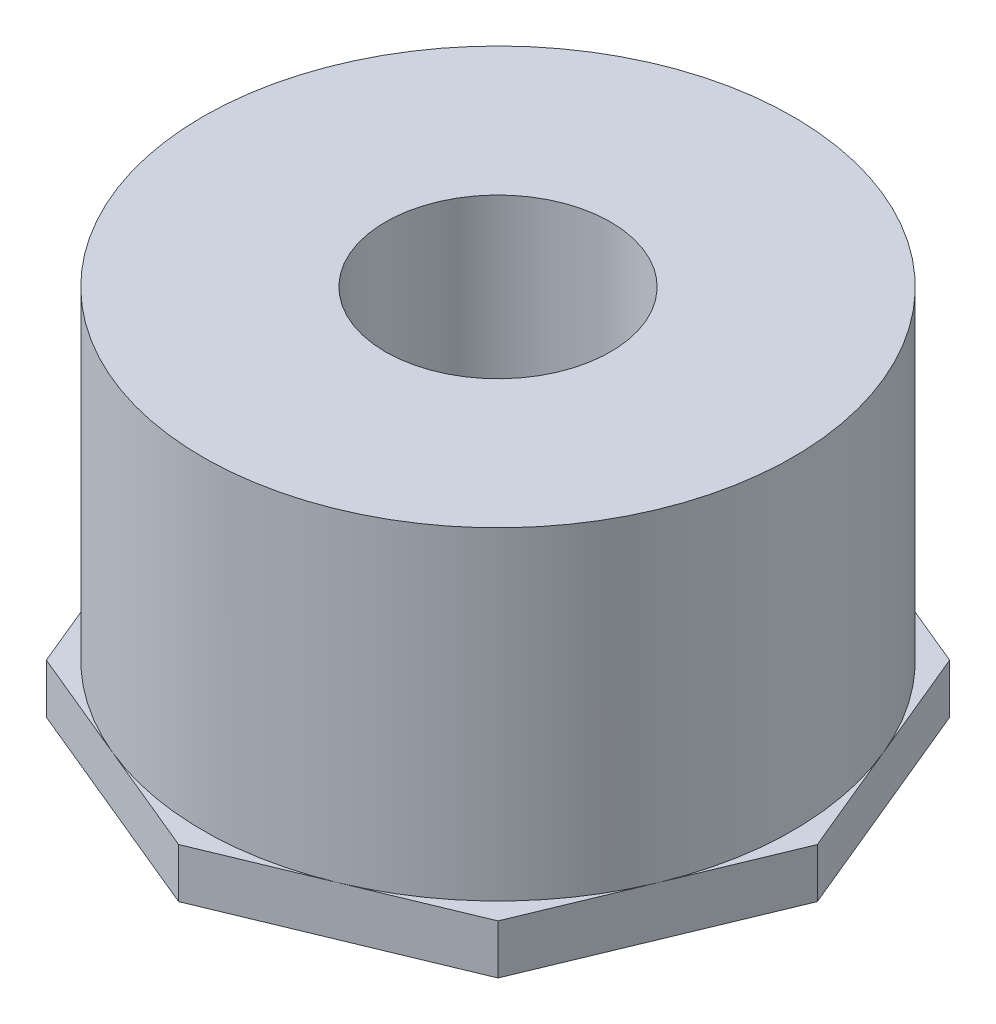
ISO-10303-21;
HEADER;
FILE_DESCRIPTION(('STEP AP214'),'2;1');
FILE_NAME('part.step','',(''),(''),'','','');
FILE_SCHEMA(('AUTOMOTIVE_DESIGN { 1 0 10303 214 1 1 1 1 }'));
ENDSEC;
DATA;
#1=APPLICATION_CONTEXT('core data for automotive mechanical design processes');
#2=APPLICATION_PROTOCOL_DEFINITION('international standard','automotive_design',2000,#1);
#3=PRODUCT_CONTEXT('',#1,'mechanical');
#4=PRODUCT('Part','Part','',(#3));
#5=PRODUCT_RELATED_PRODUCT_CATEGORY('part','',(#4));
#6=PRODUCT_DEFINITION_FORMATION('','',#4);
#7=PRODUCT_DEFINITION_CONTEXT('part definition',#1,'design');
#8=PRODUCT_DEFINITION('design','',#6,#7);
#9=PRODUCT_DEFINITION_SHAPE('','',#8);
#10=(LENGTH_UNIT() NAMED_UNIT(*) SI_UNIT(.MILLI.,.METRE.));
#11=(NAMED_UNIT(*) PLANE_ANGLE_UNIT() SI_UNIT($,.RADIAN.));
#12=(NAMED_UNIT(*) SI_UNIT($,.STERADIAN.) SOLID_ANGLE_UNIT());
#13=UNCERTAINTY_MEASURE_WITH_UNIT(LENGTH_MEASURE(1.E-05),#10,'distance_accuracy_value','');
#14=(GEOMETRIC_REPRESENTATION_CONTEXT(3) GLOBAL_UNCERTAINTY_ASSIGNED_CONTEXT((#13)) GLOBAL_UNIT_ASSIGNED_CONTEXT((#10,
#11,#12)) REPRESENTATION_CONTEXT('',''));
#15=CARTESIAN_POINT('',(0.,0.,0.));
#16=DIRECTION('',(0.,0.,1.));
#17=DIRECTION('',(1.,0.,0.));
#18=AXIS2_PLACEMENT_3D('',#15,#16,#17);
#19=CARTESIAN_POINT('',(0.,0.,0.));
#20=DIRECTION('',(0.,1.,0.));
#21=DIRECTION('',(-1.,0.,0.));
#22=AXIS2_PLACEMENT_3D('',#19,#20,#21);
#23=CYLINDRICAL_SURFACE('',#22,30.1625);
#24=CARTESIAN_POINT('',(0.,38.1,0.));
#25=DIRECTION('',(0.,1.,0.));
#26=DIRECTION('',(-1.,0.,0.));
#27=AXIS2_PLACEMENT_3D('',#24,#25,#26);
#28=CIRCLE('',#27,30.1625);
#29=CARTESIAN_POINT('',(-30.1625,38.1,0.));
#30=VERTEX_POINT('',#29);
#31=EDGE_CURVE('E206',#30,#30,#28,.T.);
#32=ORIENTED_EDGE('',*,*,#31,.F.);
#33=EDGE_LOOP('',(#32));
#34=FACE_BOUND('',#33,.T.);
#35=CARTESIAN_POINT('',(0.,5.0546,0.));
#36=DIRECTION('',(0.,-1.,0.));
#37=DIRECTION('',(1.,0.,0.));
#38=AXIS2_PLACEMENT_3D('',#35,#36,#37);
#39=CIRCLE('',#38,30.1625);
#40=CARTESIAN_POINT('',(27.8665163993717,5.0546,11.542689028712));
#41=VERTEX_POINT('',#40);
#42=CARTESIAN_POINT('',(27.8665163993717,5.0546,-11.542689028712));
#43=VERTEX_POINT('',#42);
#44=EDGE_CURVE('E47',#41,#43,#39,.F.);
#45=ORIENTED_EDGE('',*,*,#44,.T.);
#46=CARTESIAN_POINT('',(11.542689028712,5.0546,-27.8665163993717));
#47=VERTEX_POINT('',#46);
#48=EDGE_CURVE('E11',#43,#47,#39,.F.);
#49=ORIENTED_EDGE('',*,*,#48,.T.);
#50=CARTESIAN_POINT('',(-11.542689028712,5.0546,-27.8665163993717));
#51=VERTEX_POINT('',#50);
#52=EDGE_CURVE('E52',#47,#51,#39,.F.);
#53=ORIENTED_EDGE('',*,*,#52,.T.);
#54=CARTESIAN_POINT('',(-27.8665163993717,5.0546,-11.542689028712));
#55=VERTEX_POINT('',#54);
#56=EDGE_CURVE('E232',#51,#55,#39,.F.);
#57=ORIENTED_EDGE('',*,*,#56,.T.);
#58=CARTESIAN_POINT('',(-27.8665163993717,5.0546,11.542689028712));
#59=VERTEX_POINT('',#58);
#60=EDGE_CURVE('E230',#55,#59,#39,.F.);
#61=ORIENTED_EDGE('',*,*,#60,.T.);
#62=CARTESIAN_POINT('',(-11.542689028712,5.0546,27.8665163993717));
#63=VERTEX_POINT('',#62);
#64=EDGE_CURVE('E229',#59,#63,#39,.F.);
#65=ORIENTED_EDGE('',*,*,#64,.T.);
#66=CARTESIAN_POINT('',(11.542689028712,5.0546,27.8665163993717));
#67=VERTEX_POINT('',#66);
#68=EDGE_CURVE('E67',#63,#67,#39,.F.);
#69=ORIENTED_EDGE('',*,*,#68,.T.);
#70=EDGE_CURVE('E226',#67,#41,#39,.F.);
#71=ORIENTED_EDGE('',*,*,#70,.T.);
#72=EDGE_LOOP('',(#45,#49,#53,#57,#61,#65,#69,#71));
#73=FACE_BOUND('',#72,.T.);
#74=ADVANCED_FACE('F43',(#34,#73),#23,.T.);
#75=CARTESIAN_POINT('',(0.,38.1,0.));
#76=DIRECTION('',(0.,1.,0.));
#77=DIRECTION('',(-1.,0.,0.));
#78=AXIS2_PLACEMENT_3D('',#75,#76,#77);
#79=PLANE('',#78);
#80=CARTESIAN_POINT('',(0.,38.1,0.));
#81=DIRECTION('',(0.,-1.,0.));
#82=DIRECTION('',(0.,0.,-1.));
#83=AXIS2_PLACEMENT_3D('',#80,#81,#82);
#84=CIRCLE('',#83,11.5062);
#85=CARTESIAN_POINT('',(0.,38.1,-11.5062));
#86=VERTEX_POINT('',#85);
#87=EDGE_CURVE('E185',#86,#86,#84,.T.);
#88=ORIENTED_EDGE('',*,*,#87,.T.);
#89=EDGE_LOOP('',(#88));
#90=FACE_BOUND('',#89,.T.);
#91=ORIENTED_EDGE('',*,*,#31,.T.);
#92=EDGE_LOOP('',(#91));
#93=FACE_BOUND('',#92,.T.);
#94=ADVANCED_FACE('F277',(#90,#93),#79,.T.);
#95=CARTESIAN_POINT('',(23.085378057424,5.0546,23.085378057424));
#96=DIRECTION('',(0.38268343236509,0.,0.923879532511287));
#97=DIRECTION('',(0.923879532511287,0.,-0.38268343236509));
#98=AXIS2_PLACEMENT_3D('',#95,#96,#97);
#99=PLANE('',#98);
#100=DIRECTION('',(-0.923879532511287,0.,0.38268343236509));
#101=VECTOR('',#100,1.);
#102=CARTESIAN_POINT('',(23.085378057424,0.,23.085378057424));
#103=LINE('',#102,#101);
#104=CARTESIAN_POINT('',(23.085378057424,0.,23.085378057424));
#105=VERTEX_POINT('',#104);
#106=CARTESIAN_POINT('',(0.,0.,32.6476547413193));
#107=VERTEX_POINT('',#106);
#108=EDGE_CURVE('E183',#105,#107,#103,.T.);
#109=ORIENTED_EDGE('',*,*,#108,.F.);
#110=DIRECTION('',(0.,-1.,0.));
#111=VECTOR('',#110,1.);
#112=CARTESIAN_POINT('',(23.085378057424,5.0546,23.085378057424));
#113=LINE('',#112,#111);
#114=CARTESIAN_POINT('',(23.085378057424,5.0546,23.085378057424));
#115=VERTEX_POINT('',#114);
#116=EDGE_CURVE('E203',#115,#105,#113,.T.);
#117=ORIENTED_EDGE('',*,*,#116,.F.);
#118=DIRECTION('',(-0.923879532511287,0.,0.38268343236509));
#119=VECTOR('',#118,1.);
#120=CARTESIAN_POINT('',(23.085378057424,5.0546,23.085378057424));
#121=LINE('',#120,#119);
#122=EDGE_CURVE('E142',#115,#67,#121,.T.);
#123=ORIENTED_EDGE('',*,*,#122,.T.);
#124=CARTESIAN_POINT('',(0.,5.0546,32.6476547413193));
#125=VERTEX_POINT('',#124);
#126=EDGE_CURVE('E136',#67,#125,#121,.T.);
#127=ORIENTED_EDGE('',*,*,#126,.T.);
#128=DIRECTION('',(0.,-1.,0.));
#129=VECTOR('',#128,1.);
#130=CARTESIAN_POINT('',(0.,5.0546,32.6476547413193));
#131=LINE('',#130,#129);
#132=EDGE_CURVE('E139',#125,#107,#131,.T.);
#133=ORIENTED_EDGE('',*,*,#132,.T.);
#134=EDGE_LOOP('',(#109,#117,#123,#127,#133));
#135=FACE_BOUND('',#134,.T.);
#136=ADVANCED_FACE('F138',(#135),#99,.T.);
#137=CARTESIAN_POINT('',(32.6476547413193,5.0546,0.));
#138=DIRECTION('',(0.923879532511287,0.,0.38268343236509));
#139=DIRECTION('',(0.38268343236509,0.,-0.923879532511287));
#140=AXIS2_PLACEMENT_3D('',#137,#138,#139);
#141=PLANE('',#140);
#142=DIRECTION('',(-0.38268343236509,0.,0.923879532511287));
#143=VECTOR('',#142,1.);
#144=CARTESIAN_POINT('',(32.6476547413193,0.,0.));
#145=LINE('',#144,#143);
#146=CARTESIAN_POINT('',(32.6476547413193,0.,0.));
#147=VERTEX_POINT('',#146);
#148=EDGE_CURVE('E143',#147,#105,#145,.T.);
#149=ORIENTED_EDGE('',*,*,#148,.F.);
#150=DIRECTION('',(0.,-1.,0.));
#151=VECTOR('',#150,1.);
#152=CARTESIAN_POINT('',(32.6476547413193,5.0546,0.));
#153=LINE('',#152,#151);
#154=CARTESIAN_POINT('',(32.6476547413193,5.0546,0.));
#155=VERTEX_POINT('',#154);
#156=EDGE_CURVE('E207',#155,#147,#153,.T.);
#157=ORIENTED_EDGE('',*,*,#156,.F.);
#158=DIRECTION('',(-0.38268343236509,0.,0.923879532511287));
#159=VECTOR('',#158,1.);
#160=CARTESIAN_POINT('',(32.6476547413193,5.0546,0.));
#161=LINE('',#160,#159);
#162=EDGE_CURVE('E155',#155,#41,#161,.T.);
#163=ORIENTED_EDGE('',*,*,#162,.T.);
#164=EDGE_CURVE('E180',#41,#115,#161,.T.);
#165=ORIENTED_EDGE('',*,*,#164,.T.);
#166=ORIENTED_EDGE('',*,*,#116,.T.);
#167=EDGE_LOOP('',(#149,#157,#163,#165,#166));
#168=FACE_BOUND('',#167,.T.);
#169=ADVANCED_FACE('F287',(#168),#141,.T.);
#170=CARTESIAN_POINT('',(23.085378057424,5.0546,-23.085378057424));
#171=DIRECTION('',(0.923879532511287,0.,-0.38268343236509));
#172=DIRECTION('',(-0.38268343236509,0.,-0.923879532511287));
#173=AXIS2_PLACEMENT_3D('',#170,#171,#172);
#174=PLANE('',#173);
#175=ORIENTED_EDGE('',*,*,#156,.T.);
#176=DIRECTION('',(0.38268343236509,0.,0.923879532511287));
#177=VECTOR('',#176,1.);
#178=CARTESIAN_POINT('',(23.085378057424,0.,-23.085378057424));
#179=LINE('',#178,#177);
#180=CARTESIAN_POINT('',(23.085378057424,0.,-23.085378057424));
#181=VERTEX_POINT('',#180);
#182=EDGE_CURVE('E198',#181,#147,#179,.T.);
#183=ORIENTED_EDGE('',*,*,#182,.F.);
#184=DIRECTION('',(0.,-1.,0.));
#185=VECTOR('',#184,1.);
#186=CARTESIAN_POINT('',(23.085378057424,5.0546,-23.085378057424));
#187=LINE('',#186,#185);
#188=CARTESIAN_POINT('',(23.085378057424,5.0546,-23.085378057424));
#189=VERTEX_POINT('',#188);
#190=EDGE_CURVE('E210',#189,#181,#187,.T.);
#191=ORIENTED_EDGE('',*,*,#190,.F.);
#192=DIRECTION('',(0.38268343236509,0.,0.923879532511287));
#193=VECTOR('',#192,1.);
#194=CARTESIAN_POINT('',(23.085378057424,5.0546,-23.085378057424));
#195=LINE('',#194,#193);
#196=EDGE_CURVE('E59',#189,#43,#195,.T.);
#197=ORIENTED_EDGE('',*,*,#196,.T.);
#198=EDGE_CURVE('E178',#43,#155,#195,.T.);
#199=ORIENTED_EDGE('',*,*,#198,.T.);
#200=EDGE_LOOP('',(#175,#183,#191,#197,#199));
#201=FACE_BOUND('',#200,.T.);
#202=ADVANCED_FACE('F298',(#201),#174,.T.);
#203=CARTESIAN_POINT('',(0.,5.0546,-32.6476547413193));
#204=DIRECTION('',(0.382683432365089,0.,-0.923879532511287));
#205=DIRECTION('',(-0.923879532511287,0.,-0.382683432365089));
#206=AXIS2_PLACEMENT_3D('',#203,#204,#205);
#207=PLANE('',#206);
#208=DIRECTION('',(0.923879532511287,0.,0.382683432365089));
#209=VECTOR('',#208,1.);
#210=CARTESIAN_POINT('',(0.,0.,-32.6476547413193));
#211=LINE('',#210,#209);
#212=CARTESIAN_POINT('',(0.,0.,-32.6476547413193));
#213=VERTEX_POINT('',#212);
#214=EDGE_CURVE('E196',#213,#181,#211,.T.);
#215=ORIENTED_EDGE('',*,*,#214,.F.);
#216=DIRECTION('',(0.,-1.,0.));
#217=VECTOR('',#216,1.);
#218=CARTESIAN_POINT('',(0.,5.0546,-32.6476547413193));
#219=LINE('',#218,#217);
#220=CARTESIAN_POINT('',(0.,5.0546,-32.6476547413193));
#221=VERTEX_POINT('',#220);
#222=EDGE_CURVE('E213',#221,#213,#219,.T.);
#223=ORIENTED_EDGE('',*,*,#222,.F.);
#224=DIRECTION('',(0.923879532511287,0.,0.382683432365089));
#225=VECTOR('',#224,1.);
#226=CARTESIAN_POINT('',(0.,5.0546,-32.6476547413193));
#227=LINE('',#226,#225);
#228=EDGE_CURVE('E175',#221,#47,#227,.T.);
#229=ORIENTED_EDGE('',*,*,#228,.T.);
#230=EDGE_CURVE('E174',#47,#189,#227,.T.);
#231=ORIENTED_EDGE('',*,*,#230,.T.);
#232=ORIENTED_EDGE('',*,*,#190,.T.);
#233=EDGE_LOOP('',(#215,#223,#229,#231,#232));
#234=FACE_BOUND('',#233,.T.);
#235=ADVANCED_FACE('F245',(#234),#207,.T.);
#236=CARTESIAN_POINT('',(-23.085378057424,5.0546,-23.085378057424));
#237=DIRECTION('',(-0.382683432365089,0.,-0.923879532511287));
#238=DIRECTION('',(-0.923879532511287,0.,0.38268343236509));
#239=AXIS2_PLACEMENT_3D('',#236,#237,#238);
#240=PLANE('',#239);
#241=DIRECTION('',(0.923879532511287,0.,-0.382683432365089));
#242=VECTOR('',#241,1.);
#243=CARTESIAN_POINT('',(-23.085378057424,0.,-23.085378057424));
#244=LINE('',#243,#242);
#245=CARTESIAN_POINT('',(-23.085378057424,0.,-23.085378057424));
#246=VERTEX_POINT('',#245);
#247=EDGE_CURVE('E193',#246,#213,#244,.T.);
#248=ORIENTED_EDGE('',*,*,#247,.F.);
#249=DIRECTION('',(0.,-1.,0.));
#250=VECTOR('',#249,1.);
#251=CARTESIAN_POINT('',(-23.085378057424,5.0546,-23.085378057424));
#252=LINE('',#251,#250);
#253=CARTESIAN_POINT('',(-23.085378057424,5.0546,-23.085378057424));
#254=VERTEX_POINT('',#253);
#255=EDGE_CURVE('E216',#254,#246,#252,.T.);
#256=ORIENTED_EDGE('',*,*,#255,.F.);
#257=DIRECTION('',(0.923879532511287,0.,-0.382683432365089));
#258=VECTOR('',#257,1.);
#259=CARTESIAN_POINT('',(-23.085378057424,5.0546,-23.085378057424));
#260=LINE('',#259,#258);
#261=EDGE_CURVE('E171',#254,#51,#260,.T.);
#262=ORIENTED_EDGE('',*,*,#261,.T.);
#263=EDGE_CURVE('E170',#51,#221,#260,.T.);
#264=ORIENTED_EDGE('',*,*,#263,.T.);
#265=ORIENTED_EDGE('',*,*,#222,.T.);
#266=EDGE_LOOP('',(#248,#256,#262,#264,#265));
#267=FACE_BOUND('',#266,.T.);
#268=ADVANCED_FACE('F247',(#267),#240,.T.);
#269=CARTESIAN_POINT('',(-32.6476547413193,5.0546,0.));
#270=DIRECTION('',(-0.923879532511287,0.,-0.38268343236509));
#271=DIRECTION('',(-0.38268343236509,0.,0.923879532511287));
#272=AXIS2_PLACEMENT_3D('',#269,#270,#271);
#273=PLANE('',#272);
#274=DIRECTION('',(0.38268343236509,0.,-0.923879532511287));
#275=VECTOR('',#274,1.);
#276=CARTESIAN_POINT('',(-32.6476547413193,0.,0.));
#277=LINE('',#276,#275);
#278=CARTESIAN_POINT('',(-32.6476547413193,0.,0.));
#279=VERTEX_POINT('',#278);
#280=EDGE_CURVE('E190',#279,#246,#277,.T.);
#281=ORIENTED_EDGE('',*,*,#280,.F.);
#282=DIRECTION('',(0.,-1.,0.));
#283=VECTOR('',#282,1.);
#284=CARTESIAN_POINT('',(-32.6476547413193,5.0546,0.));
#285=LINE('',#284,#283);
#286=CARTESIAN_POINT('',(-32.6476547413193,5.0546,0.));
#287=VERTEX_POINT('',#286);
#288=EDGE_CURVE('E219',#287,#279,#285,.T.);
#289=ORIENTED_EDGE('',*,*,#288,.F.);
#290=DIRECTION('',(0.38268343236509,0.,-0.923879532511287));
#291=VECTOR('',#290,1.);
#292=CARTESIAN_POINT('',(-32.6476547413193,5.0546,0.));
#293=LINE('',#292,#291);
#294=EDGE_CURVE('E167',#287,#55,#293,.T.);
#295=ORIENTED_EDGE('',*,*,#294,.T.);
#296=EDGE_CURVE('E166',#55,#254,#293,.T.);
#297=ORIENTED_EDGE('',*,*,#296,.T.);
#298=ORIENTED_EDGE('',*,*,#255,.T.);
#299=EDGE_LOOP('',(#281,#289,#295,#297,#298));
#300=FACE_BOUND('',#299,.T.);
#301=ADVANCED_FACE('F256',(#300),#273,.T.);
#302=CARTESIAN_POINT('',(-23.085378057424,5.0546,23.085378057424));
#303=DIRECTION('',(-0.923879532511287,0.,0.382683432365089));
#304=DIRECTION('',(0.38268343236509,0.,0.923879532511287));
#305=AXIS2_PLACEMENT_3D('',#302,#303,#304);
#306=PLANE('',#305);
#307=DIRECTION('',(-0.382683432365089,0.,-0.923879532511287));
#308=VECTOR('',#307,1.);
#309=CARTESIAN_POINT('',(-23.085378057424,0.,23.085378057424));
#310=LINE('',#309,#308);
#311=CARTESIAN_POINT('',(-23.085378057424,0.,23.085378057424));
#312=VERTEX_POINT('',#311);
#313=EDGE_CURVE('E187',#312,#279,#310,.T.);
#314=ORIENTED_EDGE('',*,*,#313,.F.);
#315=DIRECTION('',(0.,-1.,0.));
#316=VECTOR('',#315,1.);
#317=CARTESIAN_POINT('',(-23.085378057424,5.0546,23.085378057424));
#318=LINE('',#317,#316);
#319=CARTESIAN_POINT('',(-23.085378057424,5.0546,23.085378057424));
#320=VERTEX_POINT('',#319);
#321=EDGE_CURVE('E154',#320,#312,#318,.T.);
#322=ORIENTED_EDGE('',*,*,#321,.F.);
#323=DIRECTION('',(-0.382683432365089,0.,-0.923879532511287));
#324=VECTOR('',#323,1.);
#325=CARTESIAN_POINT('',(-23.085378057424,5.0546,23.085378057424));
#326=LINE('',#325,#324);
#327=EDGE_CURVE('E161',#320,#59,#326,.T.);
#328=ORIENTED_EDGE('',*,*,#327,.T.);
#329=EDGE_CURVE('E158',#59,#287,#326,.T.);
#330=ORIENTED_EDGE('',*,*,#329,.T.);
#331=ORIENTED_EDGE('',*,*,#288,.T.);
#332=EDGE_LOOP('',(#314,#322,#328,#330,#331));
#333=FACE_BOUND('',#332,.T.);
#334=ADVANCED_FACE('F263',(#333),#306,.T.);
#335=CARTESIAN_POINT('',(0.,5.0546,32.6476547413193));
#336=DIRECTION('',(-0.38268343236509,0.,0.923879532511287));
#337=DIRECTION('',(0.923879532511287,0.,0.38268343236509));
#338=AXIS2_PLACEMENT_3D('',#335,#336,#337);
#339=PLANE('',#338);
#340=DIRECTION('',(-0.923879532511287,0.,-0.38268343236509));
#341=VECTOR('',#340,1.);
#342=CARTESIAN_POINT('',(0.,0.,32.6476547413193));
#343=LINE('',#342,#341);
#344=EDGE_CURVE('E152',#107,#312,#343,.T.);
#345=ORIENTED_EDGE('',*,*,#344,.F.);
#346=ORIENTED_EDGE('',*,*,#132,.F.);
#347=DIRECTION('',(-0.923879532511287,0.,-0.38268343236509));
#348=VECTOR('',#347,1.);
#349=CARTESIAN_POINT('',(0.,5.0546,32.6476547413193));
#350=LINE('',#349,#348);
#351=EDGE_CURVE('E148',#125,#63,#350,.T.);
#352=ORIENTED_EDGE('',*,*,#351,.T.);
#353=EDGE_CURVE('E159',#63,#320,#350,.T.);
#354=ORIENTED_EDGE('',*,*,#353,.T.);
#355=ORIENTED_EDGE('',*,*,#321,.T.);
#356=EDGE_LOOP('',(#345,#346,#352,#354,#355));
#357=FACE_BOUND('',#356,.T.);
#358=ADVANCED_FACE('F147',(#357),#339,.T.);
#359=CARTESIAN_POINT('',(0.,5.0546,0.));
#360=DIRECTION('',(0.,-1.,0.));
#361=DIRECTION('',(1.,0.,0.));
#362=AXIS2_PLACEMENT_3D('',#359,#360,#361);
#363=PLANE('',#362);
#364=ORIENTED_EDGE('',*,*,#48,.F.);
#365=ORIENTED_EDGE('',*,*,#196,.F.);
#366=ORIENTED_EDGE('',*,*,#230,.F.);
#367=EDGE_LOOP('',(#364,#365,#366));
#368=FACE_BOUND('',#367,.T.);
#369=ADVANCED_FACE('F242',(#368),#363,.F.);
#370=ORIENTED_EDGE('',*,*,#52,.F.);
#371=ORIENTED_EDGE('',*,*,#228,.F.);
#372=ORIENTED_EDGE('',*,*,#263,.F.);
#373=EDGE_LOOP('',(#370,#371,#372));
#374=FACE_BOUND('',#373,.T.);
#375=ADVANCED_FACE('F240',(#374),#363,.F.);
#376=ORIENTED_EDGE('',*,*,#56,.F.);
#377=ORIENTED_EDGE('',*,*,#261,.F.);
#378=ORIENTED_EDGE('',*,*,#296,.F.);
#379=EDGE_LOOP('',(#376,#377,#378));
#380=FACE_BOUND('',#379,.T.);
#381=ADVANCED_FACE('F252',(#380),#363,.F.);
#382=ORIENTED_EDGE('',*,*,#60,.F.);
#383=ORIENTED_EDGE('',*,*,#294,.F.);
#384=ORIENTED_EDGE('',*,*,#329,.F.);
#385=EDGE_LOOP('',(#382,#383,#384));
#386=FACE_BOUND('',#385,.T.);
#387=ADVANCED_FACE('F259',(#386),#363,.F.);
#388=ORIENTED_EDGE('',*,*,#64,.F.);
#389=ORIENTED_EDGE('',*,*,#327,.F.);
#390=ORIENTED_EDGE('',*,*,#353,.F.);
#391=EDGE_LOOP('',(#388,#389,#390));
#392=FACE_BOUND('',#391,.T.);
#393=ADVANCED_FACE('F265',(#392),#363,.F.);
#394=ORIENTED_EDGE('',*,*,#68,.F.);
#395=ORIENTED_EDGE('',*,*,#351,.F.);
#396=ORIENTED_EDGE('',*,*,#126,.F.);
#397=EDGE_LOOP('',(#394,#395,#396));
#398=FACE_BOUND('',#397,.T.);
#399=ADVANCED_FACE('F157',(#398),#363,.F.);
#400=ORIENTED_EDGE('',*,*,#70,.F.);
#401=ORIENTED_EDGE('',*,*,#122,.F.);
#402=ORIENTED_EDGE('',*,*,#164,.F.);
#403=EDGE_LOOP('',(#400,#401,#402));
#404=FACE_BOUND('',#403,.T.);
#405=ADVANCED_FACE('F272',(#404),#363,.F.);
#406=ORIENTED_EDGE('',*,*,#44,.F.);
#407=ORIENTED_EDGE('',*,*,#162,.F.);
#408=ORIENTED_EDGE('',*,*,#198,.F.);
#409=EDGE_LOOP('',(#406,#407,#408));
#410=FACE_BOUND('',#409,.T.);
#411=ADVANCED_FACE('F273',(#410),#363,.F.);
#412=CARTESIAN_POINT('',(-30.1625,0.,0.));
#413=DIRECTION('',(0.,-1.,0.));
#414=DIRECTION('',(1.,0.,0.));
#415=AXIS2_PLACEMENT_3D('',#412,#413,#414);
#416=PLANE('',#415);
#417=CARTESIAN_POINT('',(0.,0.,0.));
#418=DIRECTION('',(0.,-1.,0.));
#419=DIRECTION('',(0.,0.,-1.));
#420=AXIS2_PLACEMENT_3D('',#417,#418,#419);
#421=CIRCLE('',#420,12.558649);
#422=CARTESIAN_POINT('',(0.,0.,-12.558649));
#423=VERTEX_POINT('',#422);
#424=EDGE_CURVE('E515',#423,#423,#421,.T.);
#425=ORIENTED_EDGE('',*,*,#424,.F.);
#426=EDGE_LOOP('',(#425));
#427=FACE_BOUND('',#426,.T.);
#428=ORIENTED_EDGE('',*,*,#108,.T.);
#429=ORIENTED_EDGE('',*,*,#344,.T.);
#430=ORIENTED_EDGE('',*,*,#313,.T.);
#431=ORIENTED_EDGE('',*,*,#280,.T.);
#432=ORIENTED_EDGE('',*,*,#247,.T.);
#433=ORIENTED_EDGE('',*,*,#214,.T.);
#434=ORIENTED_EDGE('',*,*,#182,.T.);
#435=ORIENTED_EDGE('',*,*,#148,.T.);
#436=EDGE_LOOP('',(#428,#429,#430,#431,#432,#433,#434,#435));
#437=FACE_BOUND('',#436,.T.);
#438=ADVANCED_FACE('F45',(#427,#437),#416,.T.);
#439=CARTESIAN_POINT('',(0.,0.,0.));
#440=DIRECTION('',(0.,-1.,0.));
#441=DIRECTION('',(0.,0.,-1.));
#442=AXIS2_PLACEMENT_3D('',#439,#440,#441);
#443=CYLINDRICAL_SURFACE('',#442,11.5062);
#444=ORIENTED_EDGE('',*,*,#87,.F.);
#445=EDGE_LOOP('',(#444));
#446=FACE_BOUND('',#445,.T.);
#447=CARTESIAN_POINT('',(0.,14.05382,0.));
#448=DIRECTION('',(0.,-1.,0.));
#449=DIRECTION('',(0.,0.,-1.));
#450=AXIS2_PLACEMENT_3D('',#447,#448,#449);
#451=CIRCLE('',#450,11.5062);
#452=CARTESIAN_POINT('',(0.,14.05382,-11.5062));
#453=VERTEX_POINT('',#452);
#454=EDGE_CURVE('E517',#453,#453,#451,.T.);
#455=ORIENTED_EDGE('',*,*,#454,.T.);
#456=EDGE_LOOP('',(#455));
#457=FACE_BOUND('',#456,.T.);
#458=ADVANCED_FACE('F318',(#446,#457),#443,.F.);
#459=CARTESIAN_POINT('',(11.5062,14.05382,0.));
#460=DIRECTION('',(0.,1.,0.));
#461=DIRECTION('',(0.,0.,1.));
#462=AXIS2_PLACEMENT_3D('',#459,#460,#461);
#463=PLANE('',#462);
#464=ORIENTED_EDGE('',*,*,#454,.F.);
#465=EDGE_LOOP('',(#464));
#466=FACE_BOUND('',#465,.T.);
#467=CARTESIAN_POINT('',(0.,14.05382,0.));
#468=DIRECTION('',(0.,-1.,0.));
#469=DIRECTION('',(0.,0.,-1.));
#470=AXIS2_PLACEMENT_3D('',#467,#468,#469);
#471=CIRCLE('',#470,12.1378588087384);
#472=CARTESIAN_POINT('',(0.,14.05382,-12.1378588087384));
#473=VERTEX_POINT('',#472);
#474=EDGE_CURVE('E512',#473,#473,#471,.T.);
#475=ORIENTED_EDGE('',*,*,#474,.T.);
#476=EDGE_LOOP('',(#475));
#477=FACE_BOUND('',#476,.T.);
#478=ADVANCED_FACE('F383',(#466,#477),#463,.F.);
#479=CARTESIAN_POINT('',(0.,0.,0.));
#480=DIRECTION('',(0.,-1.,0.));
#481=DIRECTION('',(0.,0.,-1.));
#482=AXIS2_PLACEMENT_3D('',#479,#480,#481);
#483=CONICAL_SURFACE('',#482,12.558649,0.0299323966717026);
#484=ORIENTED_EDGE('',*,*,#474,.F.);
#485=EDGE_LOOP('',(#484));
#486=FACE_BOUND('',#485,.T.);
#487=ORIENTED_EDGE('',*,*,#424,.T.);
#488=EDGE_LOOP('',(#487));
#489=FACE_BOUND('',#488,.T.);
#490=ADVANCED_FACE('F393',(#486,#489),#483,.F.);
#491=CLOSED_SHELL('',(#74,#94,#136,#169,#202,#235,#268,#301,#334,#358,#369,#375,#381,#387,#393,
#399,#405,#411,#438,#458,#478,#490));
#492=MANIFOLD_SOLID_BREP('B2',#491);
#493=ADVANCED_BREP_SHAPE_REPRESENTATION('',(#18,#492),#14);
#494=SHAPE_DEFINITION_REPRESENTATION(#9,#493);
ENDSEC;
END-ISO-10303-21;
